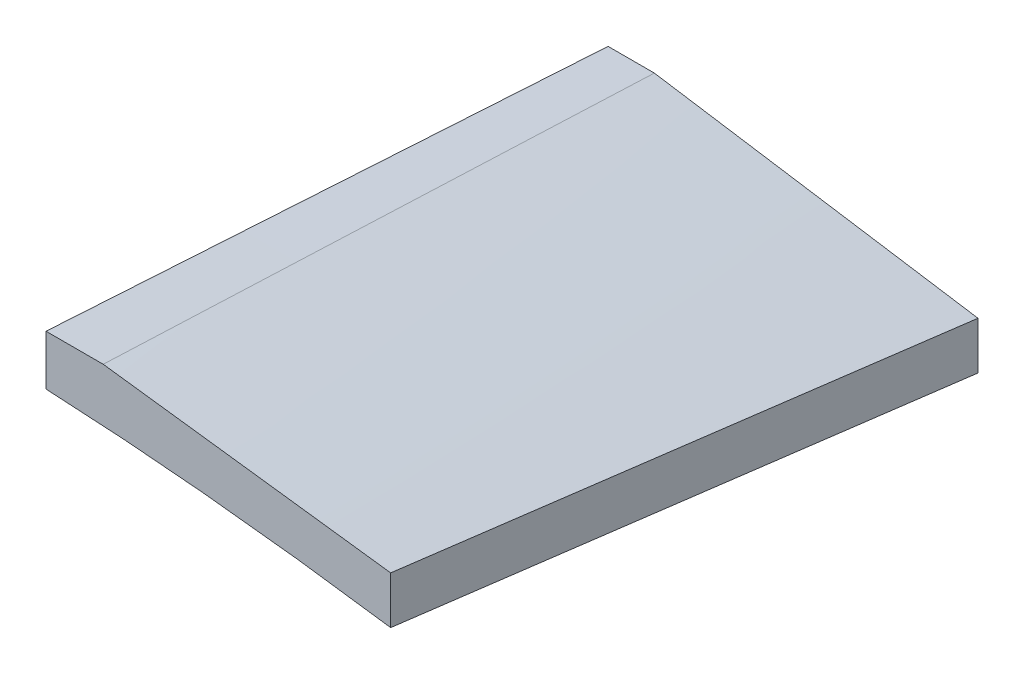
ISO-10303-21;
HEADER;
FILE_DESCRIPTION(('STEP AP214'),'2;1');
FILE_NAME('part.step','',(''),(''),'','','');
FILE_SCHEMA(('AUTOMOTIVE_DESIGN { 1 0 10303 214 1 1 1 1 }'));
ENDSEC;
DATA;
#1=APPLICATION_CONTEXT('core data for automotive mechanical design processes');
#2=APPLICATION_PROTOCOL_DEFINITION('international standard','automotive_design',2000,#1);
#3=PRODUCT_CONTEXT('',#1,'mechanical');
#4=PRODUCT('Part','Part','',(#3));
#5=PRODUCT_RELATED_PRODUCT_CATEGORY('part','',(#4));
#6=PRODUCT_DEFINITION_FORMATION('','',#4);
#7=PRODUCT_DEFINITION_CONTEXT('part definition',#1,'design');
#8=PRODUCT_DEFINITION('design','',#6,#7);
#9=PRODUCT_DEFINITION_SHAPE('','',#8);
#10=(LENGTH_UNIT() NAMED_UNIT(*) SI_UNIT(.MILLI.,.METRE.));
#11=(NAMED_UNIT(*) PLANE_ANGLE_UNIT() SI_UNIT($,.RADIAN.));
#12=(NAMED_UNIT(*) SI_UNIT($,.STERADIAN.) SOLID_ANGLE_UNIT());
#13=UNCERTAINTY_MEASURE_WITH_UNIT(LENGTH_MEASURE(1.E-05),#10,'distance_accuracy_value','');
#14=(GEOMETRIC_REPRESENTATION_CONTEXT(3) GLOBAL_UNCERTAINTY_ASSIGNED_CONTEXT((#13)) GLOBAL_UNIT_ASSIGNED_CONTEXT((#10,
#11,#12)) REPRESENTATION_CONTEXT('',''));
#15=CARTESIAN_POINT('',(0.,0.,0.));
#16=DIRECTION('',(0.,0.,1.));
#17=DIRECTION('',(1.,0.,0.));
#18=AXIS2_PLACEMENT_3D('',#15,#16,#17);
#19=CARTESIAN_POINT('',(0.,0.,619.76));
#20=DIRECTION('',(0.,0.,-1.));
#21=DIRECTION('',(-1.,0.,0.));
#22=AXIS2_PLACEMENT_3D('',#19,#20,#21);
#23=PLANE('',#22);
#24=CARTESIAN_POINT('',(122.012987748225,42.2689138855527,619.76));
#25=CARTESIAN_POINT('',(124.448241517671,42.1643767634276,619.76));
#26=CARTESIAN_POINT('',(126.882756849898,42.0438117710736,619.76));
#27=CARTESIAN_POINT('',(130.532827965172,41.8416953269316,619.76));
#28=CARTESIAN_POINT('',(131.748974807422,41.7707957864617,619.76));
#29=CARTESIAN_POINT('',(134.180864283447,41.6223601715288,619.76));
#30=CARTESIAN_POINT('',(135.396606916646,41.5448240876751,619.76));
#31=CARTESIAN_POINT('',(137.827325774478,41.3835929566903,619.76));
#32=CARTESIAN_POINT('',(139.042302119273,41.2998997180211,619.76));
#33=CARTESIAN_POINT('',(141.471841549765,41.1267282823664,619.76));
#34=CARTESIAN_POINT('',(142.686404635555,41.0372500866874,619.76));
#35=CARTESIAN_POINT('',(145.11488810786,40.8530114004872,619.76));
#36=CARTESIAN_POINT('',(146.328808573915,40.7582519561394,619.76));
#37=CARTESIAN_POINT('',(148.756268627971,40.5639758433482,619.76));
#38=CARTESIAN_POINT('',(149.969808215908,40.4644591741015,619.76));
#39=CARTESIAN_POINT('',(152.3963259651,40.2606522922155,619.76));
#40=CARTESIAN_POINT('',(153.609304179194,40.1563627089267,619.76));
#41=CARTESIAN_POINT('',(156.034834509922,39.9429445186549,619.76));
#42=CARTESIAN_POINT('',(157.247386626677,39.8338159130428,619.76));
#43=CARTESIAN_POINT('',(159.671962879002,39.610691255984,619.76));
#44=CARTESIAN_POINT('',(160.883987043973,39.4966955240975,619.76));
#45=CARTESIAN_POINT('',(163.307559130601,39.2637465944752,619.76));
#46=CARTESIAN_POINT('',(164.519107052186,39.1447933959834,619.76));
#47=CARTESIAN_POINT('',(166.941648698677,38.9018173315685,619.76));
#48=CARTESIAN_POINT('',(168.152642442773,38.7777946571532,619.76));
#49=CARTESIAN_POINT('',(170.574085315804,38.5245531442786,619.76));
#50=CARTESIAN_POINT('',(171.784534444878,38.3953343071575,619.76));
#51=CARTESIAN_POINT('',(175.415200716581,37.9997483867404,619.76));
#52=CARTESIAN_POINT('',(177.834561667416,37.7254694276855,619.76));
#53=CARTESIAN_POINT('',(181.462014219506,37.2990805125503,619.76));
#54=CARTESIAN_POINT('',(182.670991607541,37.1544442927972,619.76));
#55=CARTESIAN_POINT('',(185.088355361681,36.8603131262002,619.76));
#56=CARTESIAN_POINT('',(186.296741727862,36.7108181799761,619.76));
#57=CARTESIAN_POINT('',(189.921541429177,36.2552975464865,619.76));
#58=CARTESIAN_POINT('',(192.337081572201,35.9422966200059,619.76));
#59=CARTESIAN_POINT('',(195.959031665217,35.4602093026612,619.76));
#60=CARTESIAN_POINT('',(197.166282190393,35.2973933779906,619.76));
#61=CARTESIAN_POINT('',(199.580237180211,34.96775571681,619.76));
#62=CARTESIAN_POINT('',(200.786941644819,34.8009339800481,619.76));
#63=CARTESIAN_POINT('',(203.200168126187,34.4633045975705,619.76));
#64=CARTESIAN_POINT('',(204.406689974741,34.2924957503763,619.76));
#65=CARTESIAN_POINT('',(206.819182070088,33.9470314127565,619.76));
#66=CARTESIAN_POINT('',(208.025152317248,33.7723759248858,619.76));
#67=CARTESIAN_POINT('',(209.23084733782,33.595842069036,619.76));
#68=B_SPLINE_CURVE_WITH_KNOTS('',3,(#24,#25,#26,#27,#28,#29,#30,#31,#32,#33,#34,#35,#36,#37,#38,
#39,#40,#41,#42,#43,#44,#45,#46,#47,#48,#49,#50,#51,#52,#53,#54,#55,#56,#57,#58,#59,#60,#61,#62,
#63,#64,#65,#66,#67),.UNSPECIFIED.,.F.,.F.,(4,2,2,2,2,2,2,2,2,2,2,2,2,2,2,2,2,2,2,2,2,4),(0.,
7.31235704427351,10.9669728743561,14.6215938758074,18.275145705317,21.9286967096633,
25.5815265292785,29.2343569656651,32.886707124308,36.5390562481721,40.1911659380679,
43.8432761850205,47.4952485948345,51.1472200642427,58.4516908415903,62.1044786405917,
65.7572659736222,73.0643926505828,76.7189284709772,80.3734645211136,84.0291164232771,
87.6847658975796),.UNSPECIFIED.);
#69=CARTESIAN_POINT('',(122.012987748225,42.2689138855518,619.759999999985));
#70=VERTEX_POINT('',#69);
#71=CARTESIAN_POINT('',(209.230847337816,33.5958420690439,619.760000000093));
#72=VERTEX_POINT('',#71);
#73=EDGE_CURVE('E105',#70,#72,#68,.T.);
#74=ORIENTED_EDGE('',*,*,#73,.T.);
#75=DIRECTION('',(0.,1.,0.));
#76=VECTOR('',#75,1.);
#77=CARTESIAN_POINT('',(209.230847335755,9.36643436036436,619.76));
#78=LINE('',#77,#76);
#79=CARTESIAN_POINT('',(209.230847337816,45.5958420690439,619.760000000093));
#80=VERTEX_POINT('',#79);
#81=EDGE_CURVE('E101',#72,#80,#78,.T.);
#82=ORIENTED_EDGE('',*,*,#81,.T.);
#83=CARTESIAN_POINT('',(209.230847337821,45.5958420690359,619.76));
#84=CARTESIAN_POINT('',(201.586387683056,46.5784670200576,619.76));
#85=CARTESIAN_POINT('',(193.941928028292,47.5610919710792,619.76));
#86=CARTESIAN_POINT('',(177.996204794492,49.610767974255,619.76));
#87=CARTESIAN_POINT('',(169.694941215457,50.6778190264092,619.76));
#88=CARTESIAN_POINT('',(153.092414057386,52.8119211307177,619.76));
#89=CARTESIAN_POINT('',(144.791150478351,53.878972182872,619.76));
#90=CARTESIAN_POINT('',(136.489886899315,54.9460232350262,619.76));
#91=B_SPLINE_CURVE_WITH_KNOTS('',3,(#83,#84,#85,#86,#87,#88,#89,#90),.UNSPECIFIED.,.F.,.F.,(4,2,
2,4),(0.,23.1220638540164,48.2307510878943,73.3394383217721),.UNSPECIFIED.);
#92=CARTESIAN_POINT('',(136.489886899315,54.9460232350262,619.76));
#93=VERTEX_POINT('',#92);
#94=EDGE_CURVE('E94',#80,#93,#91,.T.);
#95=ORIENTED_EDGE('',*,*,#94,.T.);
#96=DIRECTION('',(-1.,0.,0.));
#97=VECTOR('',#96,1.);
#98=CARTESIAN_POINT('',(111.489886899315,54.9460232350262,619.76));
#99=LINE('',#98,#97);
#100=CARTESIAN_POINT('',(122.012987748225,54.9460232350253,619.759999999985));
#101=VERTEX_POINT('',#100);
#102=EDGE_CURVE('E151',#93,#101,#99,.T.);
#103=ORIENTED_EDGE('',*,*,#102,.T.);
#104=DIRECTION('',(0.,-1.,0.));
#105=VECTOR('',#104,1.);
#106=CARTESIAN_POINT('',(122.012987748225,0.,619.76));
#107=LINE('',#106,#105);
#108=EDGE_CURVE('E48',#101,#70,#107,.T.);
#109=ORIENTED_EDGE('',*,*,#108,.T.);
#110=EDGE_LOOP('',(#74,#82,#95,#103,#109));
#111=FACE_BOUND('',#110,.T.);
#112=ADVANCED_FACE('F44',(#111),#23,.F.);
#113=CARTESIAN_POINT('',(122.012987748225,6.34998004884585,335.28));
#114=DIRECTION('',(1.,0.,0.));
#115=DIRECTION('',(0.,1.,0.));
#116=AXIS2_PLACEMENT_3D('',#113,#114,#115);
#117=PLANE('',#116);
#118=CARTESIAN_POINT('',(122.012987748225,32.964943378498,477.520000000027));
#119=CARTESIAN_POINT('',(122.012987748225,33.7396427843838,489.373374631299));
#120=CARTESIAN_POINT('',(122.012987748225,34.5144885268928,501.226739698934));
#121=CARTESIAN_POINT('',(122.012987748225,36.0644899697563,524.933449559267));
#122=CARTESIAN_POINT('',(122.012987748225,36.8396456701105,536.786794351965));
#123=CARTESIAN_POINT('',(122.012987748225,38.3902843144604,560.493462533076));
#124=CARTESIAN_POINT('',(122.012987748225,39.1657672584561,572.346785921489));
#125=CARTESIAN_POINT('',(122.012987748225,40.7170777648265,596.053410156219));
#126=CARTESIAN_POINT('',(122.012987748225,41.4929053272015,607.906711002537));
#127=CARTESIAN_POINT('',(122.012987748225,42.2689138855518,619.759999999985));
#128=B_SPLINE_CURVE_WITH_KNOTS('',3,(#118,#119,#120,#121,#122,#123,#124,#125,#126,#127),
.UNSPECIFIED.,.F.,.F.,(4,2,2,2,4),(0.,35.6359908498739,71.2719816725816,106.907972496009,
142.543963346602),.UNSPECIFIED.);
#129=CARTESIAN_POINT('',(122.012987748225,32.9649433784963,477.52));
#130=VERTEX_POINT('',#129);
#131=EDGE_CURVE('E146',#130,#70,#128,.T.);
#132=ORIENTED_EDGE('',*,*,#131,.T.);
#133=ORIENTED_EDGE('',*,*,#108,.F.);
#134=CARTESIAN_POINT('',(122.012987748225,54.9460232350253,619.759999999985));
#135=CARTESIAN_POINT('',(122.012987748225,53.9285154919096,603.124421962868));
#136=CARTESIAN_POINT('',(122.012987748225,52.9113466812346,586.488823197332));
#137=CARTESIAN_POINT('',(122.012987748225,50.8776413598084,553.217587032311));
#138=CARTESIAN_POINT('',(122.012987748225,49.8611048490567,536.581949632826));
#139=CARTESIAN_POINT('',(122.012987748225,47.9809463918115,505.804208871983));
#140=CARTESIAN_POINT('',(122.012987748225,47.1172430894256,491.66211048049));
#141=CARTESIAN_POINT('',(122.012987748225,46.2537378008114,477.520000000027));
#142=B_SPLINE_CURVE_WITH_KNOTS('',3,(#134,#135,#136,#137,#138,#139,#140,#141),.UNSPECIFIED.,.F.,
.F.,(4,2,2,4),(0.,50.0000000704006,100.000000093806,142.505345312347),.UNSPECIFIED.);
#143=CARTESIAN_POINT('',(122.012987748225,46.2537378008098,477.52));
#144=VERTEX_POINT('',#143);
#145=EDGE_CURVE('E100',#101,#144,#142,.T.);
#146=ORIENTED_EDGE('',*,*,#145,.T.);
#147=DIRECTION('',(0.,-1.,0.));
#148=VECTOR('',#147,1.);
#149=CARTESIAN_POINT('',(122.012987748225,0.,477.52));
#150=LINE('',#149,#148);
#151=EDGE_CURVE('E108',#144,#130,#150,.T.);
#152=ORIENTED_EDGE('',*,*,#151,.T.);
#153=EDGE_LOOP('',(#132,#133,#146,#152));
#154=FACE_BOUND('',#153,.T.);
#155=ADVANCED_FACE('F120',(#154),#117,.F.);
#156=CARTESIAN_POINT('',(0.,0.,477.52));
#157=DIRECTION('',(0.,0.,-1.));
#158=DIRECTION('',(-1.,0.,0.));
#159=AXIS2_PLACEMENT_3D('',#156,#157,#158);
#160=PLANE('',#159);
#161=CARTESIAN_POINT('',(122.012987748225,32.9649433784963,477.52));
#162=CARTESIAN_POINT('',(123.321545248897,32.8786607647076,477.52));
#163=CARTESIAN_POINT('',(124.62981616606,32.7880799662694,477.52));
#164=CARTESIAN_POINT('',(127.245760118867,32.5987877007624,477.52));
#165=CARTESIAN_POINT('',(128.553433158991,32.5000762956549,477.52));
#166=CARTESIAN_POINT('',(131.16761456649,32.2950312707333,477.52));
#167=CARTESIAN_POINT('',(132.47412319288,32.188700945838,477.52));
#168=CARTESIAN_POINT('',(135.086540232052,31.9688943789943,477.52));
#169=CARTESIAN_POINT('',(136.392448643973,31.8554181268355,477.52));
#170=CARTESIAN_POINT('',(139.003285971061,31.6218386650376,477.52));
#171=CARTESIAN_POINT('',(140.308215061148,31.50173740807,477.52));
#172=CARTESIAN_POINT('',(142.917482006573,31.2552859550511,477.52));
#173=CARTESIAN_POINT('',(144.221819862057,31.1289357605477,477.52));
#174=CARTESIAN_POINT('',(146.829670410266,30.8705402268589,477.52));
#175=CARTESIAN_POINT('',(148.13318321504,30.7384960165901,477.52));
#176=CARTESIAN_POINT('',(150.739680426974,30.4692929187873,477.52));
#177=CARTESIAN_POINT('',(152.042664834032,30.3321340302636,477.52));
#178=CARTESIAN_POINT('',(154.647911546336,30.052696205779,477.52));
#179=CARTESIAN_POINT('',(155.950173923956,29.9104179447905,477.52));
#180=CARTESIAN_POINT('',(158.554121027166,29.6206733536585,477.52));
#181=CARTESIAN_POINT('',(159.855805752924,29.4732070250371,477.52));
#182=CARTESIAN_POINT('',(162.458487831246,29.1730656072502,477.52));
#183=CARTESIAN_POINT('',(163.759485223415,29.0203908615777,477.52));
#184=CARTESIAN_POINT('',(166.360846686585,28.7097357006451,477.52));
#185=CARTESIAN_POINT('',(167.661210757489,28.5517552845685,477.52));
#186=CARTESIAN_POINT('',(170.261218478524,28.230366143356,477.52));
#187=CARTESIAN_POINT('',(171.560862154044,28.0669576237585,477.52));
#188=CARTESIAN_POINT('',(174.159436146524,27.7345735555051,477.52));
#189=CARTESIAN_POINT('',(175.458366463669,27.5655980082786,477.52));
#190=CARTESIAN_POINT('',(179.354229747186,27.0501660324726,477.52));
#191=CARTESIAN_POINT('',(181.950046872697,26.6952275002948,477.52));
#192=CARTESIAN_POINT('',(185.841689683171,26.1467332831833,477.52));
#193=CARTESIAN_POINT('',(187.138654755783,25.9612061770152,477.52));
#194=CARTESIAN_POINT('',(189.731826764467,25.5849260150743,477.52));
#195=CARTESIAN_POINT('',(191.028033700634,25.3941729599659,477.52));
#196=CARTESIAN_POINT('',(194.916090818966,24.8143328332849,477.52));
#197=CARTESIAN_POINT('',(197.506825703627,24.4177427176567,477.52));
#198=CARTESIAN_POINT('',(201.391147734804,23.8093169061479,477.52));
#199=CARTESIAN_POINT('',(202.685797417346,23.6042232988153,477.52));
#200=CARTESIAN_POINT('',(205.274408490368,23.1897310203627,477.52));
#201=CARTESIAN_POINT('',(206.5683698808,22.98033234894,477.52));
#202=CARTESIAN_POINT('',(209.1559973362,22.5572470913426,477.52));
#203=CARTESIAN_POINT('',(210.449663189856,22.343559213511,477.52));
#204=CARTESIAN_POINT('',(213.036305992117,21.9120589734394,477.52));
#205=CARTESIAN_POINT('',(214.329282941197,21.6942466140486,477.52));
#206=CARTESIAN_POINT('',(215.621917546117,21.4744225332154,477.52));
#207=B_SPLINE_CURVE_WITH_KNOTS('',3,(#161,#162,#163,#164,#165,#166,#167,#168,#169,#170,#171,
#172,#173,#174,#175,#176,#177,#178,#179,#180,#181,#182,#183,#184,#185,#186,#187,#188,#189,#190,
#191,#192,#193,#194,#195,#196,#197,#198,#199,#200,#201,#202,#203,#204,#205,#206),.UNSPECIFIED.,
.F.,.F.,(4,2,2,2,2,2,2,2,2,2,2,2,2,2,2,2,2,2,2,2,2,2,4),(0.,3.93418541521632,7.86834085179417,
11.8008050533507,15.733274873919,19.6645917575364,23.5959076673278,27.5264476916494,
31.4569884764975,35.3870129177525,39.317036205941,43.2468008098117,47.1765660183761,
51.1061825933162,55.0357981593801,62.895598077023,66.8260922316671,70.7565858866184,
78.6192444003735,82.5516217434674,86.4839993630797,90.4175794984262,94.3511569166042),.UNSPECIFIED.);
#208=CARTESIAN_POINT('',(215.621917546109,21.4744225332311,477.520000000185));
#209=VERTEX_POINT('',#208);
#210=EDGE_CURVE('E145',#130,#209,#207,.T.);
#211=ORIENTED_EDGE('',*,*,#210,.F.);
#212=ORIENTED_EDGE('',*,*,#151,.F.);
#213=DIRECTION('',(-1.,0.,0.));
#214=VECTOR('',#213,1.);
#215=CARTESIAN_POINT('',(108.722936009759,46.2537378008098,477.52));
#216=LINE('',#215,#214);
#217=CARTESIAN_POINT('',(133.722936009759,46.2537378008098,477.52));
#218=VERTEX_POINT('',#217);
#219=EDGE_CURVE('E180',#218,#144,#216,.T.);
#220=ORIENTED_EDGE('',*,*,#219,.F.);
#221=CARTESIAN_POINT('',(215.621917546117,33.4744225332154,477.52));
#222=CARTESIAN_POINT('',(208.006711817888,34.6626804700425,477.52));
#223=CARTESIAN_POINT('',(200.391506089658,35.8509384068696,477.52));
#224=CARTESIAN_POINT('',(185.1610946332,38.2274542805238,477.52));
#225=CARTESIAN_POINT('',(177.54588890497,39.4157122173509,477.52));
#226=CARTESIAN_POINT('',(157.86143412108,42.4872260363886,477.52));
#227=CARTESIAN_POINT('',(145.79218506542,44.3704819185992,477.52));
#228=CARTESIAN_POINT('',(133.722936009759,46.2537378008098,477.52));
#229=B_SPLINE_CURVE_WITH_KNOTS('',3,(#221,#222,#223,#224,#225,#226,#227,#228),.UNSPECIFIED.,.F.,
.F.,(4,2,2,4),(0.,23.1220638540165,46.244127708033,82.8900119157991),.UNSPECIFIED.);
#230=CARTESIAN_POINT('',(215.621917546109,33.4744225332311,477.520000000185));
#231=VERTEX_POINT('',#230);
#232=EDGE_CURVE('E187',#231,#218,#229,.T.);
#233=ORIENTED_EDGE('',*,*,#232,.F.);
#234=DIRECTION('',(0.,1.,0.));
#235=VECTOR('',#234,1.);
#236=CARTESIAN_POINT('',(215.62191754199,9.36643436036436,477.52));
#237=LINE('',#236,#235);
#238=EDGE_CURVE('E61',#209,#231,#237,.T.);
#239=ORIENTED_EDGE('',*,*,#238,.F.);
#240=EDGE_LOOP('',(#211,#212,#220,#233,#239));
#241=FACE_BOUND('',#240,.T.);
#242=ADVANCED_FACE('F113',(#241),#160,.T.);
#243=CARTESIAN_POINT('',(130.956058059283,37.574856415899,335.28));
#244=CARTESIAN_POINT('',(133.722938387168,46.2481983373047,477.52169947526));
#245=CARTESIAN_POINT('',(136.489876885067,54.9368025875343,619.762103902452));
#246=CARTESIAN_POINT('',(139.256928095494,63.6548897190744,762.));
#247=CARTESIAN_POINT('',(126.789391392616,37.5748564158991,335.28));
#248=CARTESIAN_POINT('',(129.556271720501,46.2481983373047,477.52169947526));
#249=CARTESIAN_POINT('',(132.3232102184,54.9368025875343,619.762103902452));
#250=CARTESIAN_POINT('',(135.090261428827,63.6548897190744,762.));
#251=CARTESIAN_POINT('',(118.456058059283,37.574856415899,335.28));
#252=CARTESIAN_POINT('',(121.222938387168,46.2481983373047,477.52169947526));
#253=CARTESIAN_POINT('',(123.989876885067,54.9368025875344,619.762103902452));
#254=CARTESIAN_POINT('',(126.756928095494,63.6548897190745,762.000000000001));
#255=CARTESIAN_POINT('',(105.956058059283,37.5748564158991,335.28));
#256=CARTESIAN_POINT('',(108.722938387168,46.2481983373046,477.52169947526));
#257=CARTESIAN_POINT('',(111.489876885067,54.9368025875342,619.762103902451));
#258=CARTESIAN_POINT('',(114.256928095494,63.6548897190743,761.999999999999));
#259=CARTESIAN_POINT('',(93.4560580592829,37.574856415899,335.28));
#260=CARTESIAN_POINT('',(96.222938387168,46.2481983373047,477.52169947526));
#261=CARTESIAN_POINT('',(98.989876885067,54.9368025875343,619.762103902452));
#262=CARTESIAN_POINT('',(101.756928095494,63.6548897190744,762.));
#263=CARTESIAN_POINT('',(85.1227247259497,37.574856415899,335.28));
#264=CARTESIAN_POINT('',(87.8896050538347,46.2481983373046,477.52169947526));
#265=CARTESIAN_POINT('',(90.6565435517336,54.9368025875343,619.762103902452));
#266=CARTESIAN_POINT('',(93.4235947621608,63.6548897190744,762.));
#267=CARTESIAN_POINT('',(80.956058059283,37.5748564158991,335.28));
#268=CARTESIAN_POINT('',(83.722938387168,46.2481983373047,477.52169947526));
#269=CARTESIAN_POINT('',(86.489876885067,54.9368025875343,619.762103902452));
#270=CARTESIAN_POINT('',(89.2569280954942,63.6548897190744,762.));
#271=B_SPLINE_SURFACE_WITH_KNOTS('',3,3,((#243,#244,#245,#246),(#247,#248,#249,#250),(#251,#252,
#253,#254),(#255,#256,#257,#258),(#259,#260,#261,#262),(#263,#264,#265,#266),(#267,#268,#269,
#270)),.UNSPECIFIED.,.F.,.F.,.F.,(4,1,1,1,4),(4,4),(0.19667758886926,0.224376205647247,
0.252074822425234,0.279773439203221,0.307472055981208),(0.,1.),.UNSPECIFIED.);
#272=CARTESIAN_POINT('',(130.956058059283,37.574856415899,335.28));
#273=CARTESIAN_POINT('',(133.722938387168,46.2481983373047,477.52169947526));
#274=CARTESIAN_POINT('',(136.489876885067,54.9368025875343,619.762103902452));
#275=CARTESIAN_POINT('',(139.256928095494,63.6548897190744,762.));
#276=B_SPLINE_CURVE_WITH_KNOTS('',3,(#272,#273,#274,#275),.UNSPECIFIED.,.F.,.F.,(4,4),(0.,1.),.UNSPECIFIED.);
#277=EDGE_CURVE('E54',#218,#93,#276,.T.);
#278=ORIENTED_EDGE('',*,*,#277,.F.);
#279=ORIENTED_EDGE('',*,*,#219,.T.);
#280=ORIENTED_EDGE('',*,*,#145,.F.);
#281=ORIENTED_EDGE('',*,*,#102,.F.);
#282=EDGE_LOOP('',(#278,#279,#280,#281));
#283=FACE_BOUND('',#282,.T.);
#284=ADVANCED_FACE('F119',(#283),#271,.T.);
#285=CARTESIAN_POINT('',(222.012987748225,21.3664343603644,335.28));
#286=CARTESIAN_POINT('',(215.621841191138,33.4689125503059,477.52169947526));
#287=CARTESIAN_POINT('',(209.230752804065,45.5866530690714,619.762103902452));
#288=CARTESIAN_POINT('',(202.839777129521,57.7338764691475,762.));
#289=CARTESIAN_POINT('',(214.424910274146,22.7171361983256,335.28));
#290=CARTESIAN_POINT('',(208.796932624141,34.5338530325558,477.52169947526));
#291=CARTESIAN_POINT('',(203.169013144149,46.36583219561,619.762103902452));
#292=CARTESIAN_POINT('',(197.541206376685,58.2272942399747,762.));
#293=CARTESIAN_POINT('',(199.24875532599,25.418539874248,335.28));
#294=CARTESIAN_POINT('',(195.147115490146,36.6637339970556,477.52169947526));
#295=CARTESIAN_POINT('',(191.045533824316,47.9241904486871,619.762103902452));
#296=CARTESIAN_POINT('',(186.944064871014,59.2141297816292,762.));
#297=CARTESIAN_POINT('',(176.484522903754,29.4706453881317,335.28));
#298=CARTESIAN_POINT('',(174.672389789153,39.8585554438053,477.52169947526));
#299=CARTESIAN_POINT('',(172.860314844566,50.2617278283029,619.762103902452));
#300=CARTESIAN_POINT('',(171.048352612508,60.694383094111,762.000000000001));
#301=CARTESIAN_POINT('',(153.720290481519,33.5227509020154,335.28));
#302=CARTESIAN_POINT('',(154.197664088161,43.053376890555,477.52169947526));
#303=CARTESIAN_POINT('',(154.675095864817,52.5992652079185,619.762103902451));
#304=CARTESIAN_POINT('',(155.152640354001,62.1746364065926,761.999999999999));
#305=CARTESIAN_POINT('',(138.544135533361,36.2241545779378,335.28));
#306=CARTESIAN_POINT('',(140.547846954166,45.1832578550548,477.52169947526));
#307=CARTESIAN_POINT('',(142.551616544983,54.1576234609957,619.762103902452));
#308=CARTESIAN_POINT('',(144.55549884833,63.1614719482472,762.));
#309=CARTESIAN_POINT('',(130.956058059283,37.574856415899,335.28));
#310=CARTESIAN_POINT('',(133.722938387168,46.2481983373047,477.52169947526));
#311=CARTESIAN_POINT('',(136.489876885067,54.9368025875343,619.762103902452));
#312=CARTESIAN_POINT('',(139.256928095494,63.6548897190744,762.));
#313=B_SPLINE_SURFACE_WITH_KNOTS('',3,3,((#285,#286,#287,#288),(#289,#290,#291,#292),(#293,#294,
#295,#296),(#297,#298,#299,#300),(#301,#302,#303,#304),(#305,#306,#307,#308),(#309,#310,#311,
#312)),.UNSPECIFIED.,.F.,.F.,.F.,(4,1,1,1,4),(4,4),(0.0265906721068675,0.0691124012974655,
0.111634130488064,0.154155859678662,0.19667758886926),(0.,1.),.UNSPECIFIED.);
#314=CARTESIAN_POINT('',(222.012987748225,21.3664343603644,335.28));
#315=CARTESIAN_POINT('',(215.621841191138,33.4689125503059,477.52169947526));
#316=CARTESIAN_POINT('',(209.230752804065,45.5866530690714,619.762103902452));
#317=CARTESIAN_POINT('',(202.839777129521,57.7338764691475,762.));
#318=B_SPLINE_CURVE_WITH_KNOTS('',3,(#314,#315,#316,#317),.UNSPECIFIED.,.F.,.F.,(4,4),(0.,1.),.UNSPECIFIED.);
#319=EDGE_CURVE('E11',#231,#80,#318,.T.);
#320=ORIENTED_EDGE('',*,*,#319,.F.);
#321=ORIENTED_EDGE('',*,*,#232,.T.);
#322=ORIENTED_EDGE('',*,*,#277,.T.);
#323=ORIENTED_EDGE('',*,*,#94,.F.);
#324=EDGE_LOOP('',(#320,#321,#322,#323));
#325=FACE_BOUND('',#324,.T.);
#326=ADVANCED_FACE('F96',(#325),#313,.T.);
#327=CARTESIAN_POINT('',(9.29077044004429E-07,6.34998004884775,335.28));
#328=CARTESIAN_POINT('',(8.33297207421032,14.5787844685806,477.52169947526));
#329=CARTESIAN_POINT('',(16.6660013893575,22.8228512171374,619.762103902452));
#330=CARTESIAN_POINT('',(24.9991434170329,31.0964008470047,762.));
#331=CARTESIAN_POINT('',(9.29077600369592E-07,7.45438325082316,335.28));
#332=CARTESIAN_POINT('',(8.33297207421069,15.6111681299376,477.52169947526));
#333=CARTESIAN_POINT('',(16.6660013893577,23.783215337876,619.762103902452));
#334=CARTESIAN_POINT('',(24.9991434170329,31.9847454271249,762.));
#335=CARTESIAN_POINT('',(0.969916519496457,9.6613167038059,335.28));
#336=CARTESIAN_POINT('',(9.22997388777417,17.6892352496878,477.521699475259));
#337=CARTESIAN_POINT('',(17.4900894260658,25.7324161243937,619.762103902451));
#338=CARTESIAN_POINT('',(25.7503176768857,33.8050798804101,762.));
#339=CARTESIAN_POINT('',(3.44848156516794,12.0366302116868,335.28));
#340=CARTESIAN_POINT('',(11.5121687647093,19.9379477005165,477.52169947526));
#341=CARTESIAN_POINT('',(19.5759141342645,27.8545275181702,619.762103902452));
#342=CARTESIAN_POINT('',(27.639772216348,35.8005902171344,762.000000000001));
#343=CARTESIAN_POINT('',(5.45941166538086,13.4428022435293,335.28));
#344=CARTESIAN_POINT('',(13.3630371949687,21.2745392258276,477.521699475259));
#345=CARTESIAN_POINT('',(21.2667208945703,29.1215385369498,619.762103902452));
#346=CARTESIAN_POINT('',(29.1705173067003,36.9980207293825,762.));
#347=CARTESIAN_POINT('',(6.98203766683405,14.316970710559,335.28));
#348=CARTESIAN_POINT('',(14.7696273274846,22.112594899526,477.52169947526));
#349=CARTESIAN_POINT('',(22.557275158149,29.923481417317,619.762103902452));
#350=CARTESIAN_POINT('',(30.3450357013417,37.7638508164184,762.));
#351=CARTESIAN_POINT('',(8.54472942418297,15.0888371575498,335.28));
#352=CARTESIAN_POINT('',(16.217370772052,22.8607836546203,477.52169947526));
#353=CARTESIAN_POINT('',(23.8900702899349,30.6479924805147,619.762103902452));
#354=CARTESIAN_POINT('',(31.5628825203461,38.4646841877197,762.));
#355=CARTESIAN_POINT('',(10.1582127248828,15.8184229079955,335.28));
#356=CARTESIAN_POINT('',(17.7118720922566,23.5698254554367,477.521699475259));
#357=CARTESIAN_POINT('',(25.2655896296443,31.3364903317018,619.762103902451));
#358=CARTESIAN_POINT('',(32.8194198795603,39.1326380892775,761.999999999999));
#359=CARTESIAN_POINT('',(11.8098506399446,16.4960217707987,335.28));
#360=CARTESIAN_POINT('',(19.2427460811811,24.2313837922629,477.521699475261));
#361=CARTESIAN_POINT('',(26.6756996924314,31.9820081425512,619.762103902453));
#362=CARTESIAN_POINT('',(34.1087660162101,39.76211537415,762.000000000002));
#363=CARTESIAN_POINT('',(13.4900691645311,17.1289319071832,335.28));
#364=CARTESIAN_POINT('',(20.801220906549,24.8518102555458,477.521699475259));
#365=CARTESIAN_POINT('',(28.1124308185809,32.5899509327323,619.762103902451));
#366=CARTESIAN_POINT('',(35.423753443141,40.3575744912294,761.999999999999));
#367=CARTESIAN_POINT('',(15.1903900958544,17.7169000721208,335.28));
#368=CARTESIAN_POINT('',(22.3776261706481,25.4304482833263,477.52169947526));
#369=CARTESIAN_POINT('',(29.5649204154557,33.1592588233557,619.762103902452));
#370=CARTESIAN_POINT('',(36.7523273727916,40.9175522446957,761.999999999999));
#371=CARTESIAN_POINT('',(17.465921328655,18.443907318319,335.28));
#372=CARTESIAN_POINT('',(24.4893873514633,26.1494155039185,477.52169947526));
#373=CARTESIAN_POINT('',(31.5129115442856,33.870186018342,619.762103902453));
#374=CARTESIAN_POINT('',(38.5365484496361,41.620439414076,762.000000000001));
#375=CARTESIAN_POINT('',(20.3261253650035,19.2567063001384,335.28));
#376=CARTESIAN_POINT('',(27.1442798687524,26.9590316546654,477.521699475259));
#377=CARTESIAN_POINT('',(33.9624925425152,34.6766193380163,619.76210390245));
#378=CARTESIAN_POINT('',(40.7808179288063,42.4236899026778,761.999999999998));
#379=CARTESIAN_POINT('',(23.7782685903277,20.118367205322,335.28));
#380=CARTESIAN_POINT('',(30.3520648212409,27.826403434635,477.52169947526));
#381=CARTESIAN_POINT('',(36.9259192221679,35.549701992772,619.762103902453));
#382=CARTESIAN_POINT('',(43.4998863356233,43.3024834322195,762.000000000001));
#383=CARTESIAN_POINT('',(27.2569743923509,20.9064140542042,335.28));
#384=CARTESIAN_POINT('',(33.5853102584017,28.6257194399167,477.52169947526));
#385=CARTESIAN_POINT('',(39.9137042944664,36.3602871544532,619.762103902451));
#386=CARTESIAN_POINT('',(46.2422110430595,44.1243377503001,761.999999999999));
#387=CARTESIAN_POINT('',(30.7542530905361,21.6165466303187,335.279999999999));
#388=CARTESIAN_POINT('',(36.8375774721128,29.3523453451718,477.521699475259));
#389=CARTESIAN_POINT('',(42.9209600237033,37.103406388849,619.762103902451));
#390=CARTESIAN_POINT('',(49.0044552878221,44.8839503138367,762.));
#391=CARTESIAN_POINT('',(34.2664636940487,22.2460759079554,335.280000000001));
#392=CARTESIAN_POINT('',(40.1050244166742,30.0039988320751,477.52169947526));
#393=CARTESIAN_POINT('',(45.9436433093136,37.7771840850187,619.762103902452));
#394=CARTESIAN_POINT('',(51.7823749144814,45.579852219273,762.));
#395=CARTESIAN_POINT('',(37.7902260736038,22.8004936568621,335.279999999999));
#396=CARTESIAN_POINT('',(43.384705041758,30.5859470440672,477.521699475259));
#397=CARTESIAN_POINT('',(48.979242179926,38.3866627600962,619.762103902451));
#398=CARTESIAN_POINT('',(54.5738920306224,46.2168613574358,761.999999999999));
#399=CARTESIAN_POINT('',(41.3242497765985,23.2878811261495,335.28));
#400=CARTESIAN_POINT('',(46.675131793767,31.1056757552862,477.52169947526));
#401=CARTESIAN_POINT('',(52.0260719809494,38.9387327132469,619.762103902453));
#402=CARTESIAN_POINT('',(57.3771248806601,46.8012725525181,762.000000000001));
#403=CARTESIAN_POINT('',(44.8658239828752,23.7149223381359,335.28));
#404=CARTESIAN_POINT('',(49.9736457372606,31.5693936302263,477.521699475259));
#405=CARTESIAN_POINT('',(55.0815256616599,39.4391272511406,619.762103902451));
#406=CARTESIAN_POINT('',(60.1895182985876,47.3383437533655,761.999999999999));
#407=CARTESIAN_POINT('',(48.4136829142244,24.0896238833925,335.28));
#408=CARTESIAN_POINT('',(53.2790352364492,31.9845911908484,477.52169947526));
#409=CARTESIAN_POINT('',(58.144445728688,39.8948208271283,619.762103902453));
#410=CARTESIAN_POINT('',(63.009968933455,47.8345333447187,762.000000000001));
#411=CARTESIAN_POINT('',(53.1486242463732,24.5260190039242,335.28));
#412=CARTESIAN_POINT('',(57.6912752508218,32.4792550117327,477.521699475259));
#413=CARTESIAN_POINT('',(62.2339844252844,40.4477533483652,619.762103902451));
#414=CARTESIAN_POINT('',(66.7768063122753,48.4457345663082,761.999999999999));
#415=CARTESIAN_POINT('',(59.0789436792651,24.9574757661192,335.28));
#416=CARTESIAN_POINT('',(63.2200221820315,32.9915421905065,477.52169947526));
#417=CARTESIAN_POINT('',(67.3611588548119,41.0408709437178,619.762103902453));
#418=CARTESIAN_POINT('',(71.5024082401206,49.1196825782396,762.000000000001));
#419=CARTESIAN_POINT('',(66.2030814892412,25.3140522243183,335.28));
#420=CARTESIAN_POINT('',(69.8642211934628,33.4561192258002,477.52169947526));
#421=CARTESIAN_POINT('',(73.5254190676983,41.613448556106,619.762103902451));
#422=CARTESIAN_POINT('',(77.1867296544622,49.8002607677224,761.999999999999));
#423=CARTESIAN_POINT('',(73.3339674682549,25.523312736422,335.279999999999));
#424=CARTESIAN_POINT('',(76.5177056557658,33.7833803999775,477.52169947526));
#425=CARTESIAN_POINT('',(79.7015020132907,42.0587103923571,619.762103902452));
#426=CARTESIAN_POINT('',(82.8854110833438,50.3635232660471,762.000000000001));
#427=CARTESIAN_POINT('',(80.4669900342226,25.5957976291351,335.280000000001));
#428=CARTESIAN_POINT('',(83.1755672296286,33.9831036079315,477.52169947526));
#429=CARTESIAN_POINT('',(85.8842025950485,42.3856719155519,619.762103902451));
#430=CARTESIAN_POINT('',(88.5929506729966,50.8177231044828,761.999999999999));
#431=CARTESIAN_POINT('',(87.6002131526684,25.5406730290278,335.279999999999));
#432=CARTESIAN_POINT('',(89.8360561254533,34.0637012643954,477.521699475259));
#433=CARTESIAN_POINT('',(92.071957268252,42.6019918285869,619.762103902452));
#434=CARTESIAN_POINT('',(94.3079711235791,51.1697652740891,762.));
#435=CARTESIAN_POINT('',(94.731344048156,25.3623320865792,335.28));
#436=CARTESIAN_POINT('',(96.4968287829496,34.0292359395454,477.52169947526));
#437=CARTESIAN_POINT('',(98.262371687757,42.7114021213355,619.762103902453));
#438=CARTESIAN_POINT('',(100.028027305093,51.4230511844363,762.000000000001));
#439=CARTESIAN_POINT('',(101.858719846003,25.0679177013017,335.28));
#440=CARTESIAN_POINT('',(103.156275912104,33.8864442696627,477.521699475259));
#441=CARTESIAN_POINT('',(104.453890148219,42.7202331668477,619.762103902451));
#442=CARTESIAN_POINT('',(105.751617096862,51.5835049453433,761.999999999999));
#443=CARTESIAN_POINT('',(108.98145520224,24.6671471282029,335.28));
#444=CARTESIAN_POINT('',(109.813353159231,33.6444202192184,477.52169947526));
#445=CARTESIAN_POINT('',(110.645309286237,42.6369556390579,619.762103902452));
#446=CARTESIAN_POINT('',(111.477378125771,51.6589739402079,762.));
#447=CARTESIAN_POINT('',(116.098371799005,24.1694505600281,335.28));
#448=CARTESIAN_POINT('',(116.466790352252,33.3119415656027,477.521699475259));
#449=CARTESIAN_POINT('',(116.835267075513,42.4696949000013,619.762103902452));
#450=CARTESIAN_POINT('',(117.203856511302,51.6569311157104,762.));
#451=CARTESIAN_POINT('',(123.208750062991,23.5842845444573,335.280000000001));
#452=CARTESIAN_POINT('',(123.115731295253,32.8978674091282,477.52169947526));
#453=CARTESIAN_POINT('',(123.022770697529,42.2267126026231,619.762103902452));
#454=CARTESIAN_POINT('',(122.929922812333,51.5850406774286,762.));
#455=CARTESIAN_POINT('',(130.310988961638,22.921250348438,335.279999999999));
#456=CARTESIAN_POINT('',(129.758512205833,32.411084966105,477.521699475259));
#457=CARTESIAN_POINT('',(129.206093620042,41.9161819125961,619.762103902451));
#458=CARTESIAN_POINT('',(128.65378774678,51.4507617403976,761.999999999999));
#459=CARTESIAN_POINT('',(137.406778455928,22.1873993770708,335.28));
#460=CARTESIAN_POINT('',(136.396633479512,31.8582341206284,477.52169947526));
#461=CARTESIAN_POINT('',(135.38654667311,41.54433119301,619.762103902452));
#462=CARTESIAN_POINT('',(134.376572579236,51.2599111467022,762.));
#463=CARTESIAN_POINT('',(144.494202314858,21.3909417632401,335.28));
#464=CARTESIAN_POINT('',(143.028083804604,31.2468918148837,477.521699475259));
#465=CARTESIAN_POINT('',(141.562023464364,41.1181041953513,619.762103902451));
#466=CARTESIAN_POINT('',(140.096075836652,51.0187994571294,761.999999999999));
#467=CARTESIAN_POINT('',(153.939247988962,20.2535758150893,335.280000000001));
#468=CARTESIAN_POINT('',(151.866994129968,30.3616126018442,477.52169947526));
#469=CARTESIAN_POINT('',(149.794798440988,40.4849117174231,619.762103902452));
#470=CARTESIAN_POINT('',(147.722715464536,50.6376937143126,762.));
#471=CARTESIAN_POINT('',(165.724997703164,18.7151343960646,335.279999999999));
#472=CARTESIAN_POINT('',(162.898490334251,29.1457414177919,477.521699475259));
#473=CARTESIAN_POINT('',(160.072041135351,39.5916107683432,619.762103902452));
#474=CARTESIAN_POINT('',(157.24570464898,50.066963000205,762.));
#475=CARTESIAN_POINT('',(179.846765687905,16.6757724994209,335.28));
#476=CARTESIAN_POINT('',(176.120250526412,27.5053845131493,477.52169947526));
#477=CARTESIAN_POINT('',(172.393793534932,38.3502588557017,619.762103902452));
#478=CARTESIAN_POINT('',(168.667449255981,49.2246160795646,762.));
#479=CARTESIAN_POINT('',(193.933550227643,14.4286098676329,335.28));
#480=CARTESIAN_POINT('',(189.313154974693,25.670161061974,477.52169947526));
#481=CARTESIAN_POINT('',(184.692817891756,36.926974585139,619.762103902452));
#482=CARTESIAN_POINT('',(180.072593521347,48.2132709896145,762.));
#483=CARTESIAN_POINT('',(207.990516041457,11.9899167572326,335.28));
#484=CARTESIAN_POINT('',(202.481883538507,23.6559759384714,477.52169947526));
#485=CARTESIAN_POINT('',(196.97330920557,35.3372974485342,619.762103902452));
#486=CARTESIAN_POINT('',(191.464847585162,47.0481018399075,762.));
#487=CARTESIAN_POINT('',(217.341938436305,10.2573401873864,335.28));
#488=CARTESIAN_POINT('',(211.244446134889,22.2133306080831,477.52169947526));
#489=CARTESIAN_POINT('',(205.147012003487,34.1845833576038,619.762103902452));
#490=CARTESIAN_POINT('',(199.049690584614,46.1853189884351,762.));
#491=CARTESIAN_POINT('',(222.012987748225,9.36643436036436,335.28));
#492=CARTESIAN_POINT('',(215.621841191138,21.4689125503059,477.52169947526));
#493=CARTESIAN_POINT('',(209.230752804065,33.5866530690714,619.762103902452));
#494=CARTESIAN_POINT('',(202.839777129521,45.7338764691475,762.));
#495=B_SPLINE_SURFACE_WITH_KNOTS('',3,3,((#327,#328,#329,#330),(#331,#332,#333,#334),(#335,#336,
#337,#338),(#339,#340,#341,#342),(#343,#344,#345,#346),(#347,#348,#349,#350),(#351,#352,#353,
#354),(#355,#356,#357,#358),(#359,#360,#361,#362),(#363,#364,#365,#366),(#367,#368,#369,#370),
(#371,#372,#373,#374),(#375,#376,#377,#378),(#379,#380,#381,#382),(#383,#384,#385,#386),(#387,
#388,#389,#390),(#391,#392,#393,#394),(#395,#396,#397,#398),(#399,#400,#401,#402),(#403,#404,
#405,#406),(#407,#408,#409,#410),(#411,#412,#413,#414),(#415,#416,#417,#418),(#419,#420,#421,
#422),(#423,#424,#425,#426),(#427,#428,#429,#430),(#431,#432,#433,#434),(#435,#436,#437,#438),
(#439,#440,#441,#442),(#443,#444,#445,#446),(#447,#448,#449,#450),(#451,#452,#453,#454),(#455,
#456,#457,#458),(#459,#460,#461,#462),(#463,#464,#465,#466),(#467,#468,#469,#470),(#471,#472,
#473,#474),(#475,#476,#477,#478),(#479,#480,#481,#482),(#483,#484,#485,#486),(#487,#488,#489,
#490),(#491,#492,#493,#494)),.UNSPECIFIED.,.F.,.F.,.F.,(4,1,1,1,1,1,1,1,1,1,1,1,1,1,1,1,1,1,1,1,
1,1,1,1,1,1,1,1,1,1,1,1,1,1,1,1,1,1,1,4),(4,4),(0.548393358469235,0.555449712243154,
0.562506066017072,0.566034242904031,0.56956241979099,0.573090596677949,0.576618773564908,
0.580146950451867,0.583675127338826,0.587203304225785,0.590731481112744,0.597787834886663,
0.604844188660581,0.611900542434499,0.618956896208417,0.626013249982335,0.633069603756254,
0.640125957530172,0.64718231130409,0.654238665078008,0.661295018851926,0.675407726399763,
0.689520433947599,0.703633141495436,0.717745849043272,0.731858556591108,0.745971264138945,
0.760083971686781,0.774196679234618,0.788309386782454,0.80242209433029,0.816534801878127,
0.830647509425963,0.8447602169738,0.858872924521636,0.887098339617309,0.915323754712982,
0.943549169808654,0.971774584904327,1.),(0.,1.),.UNSPECIFIED.);
#496=CARTESIAN_POINT('',(222.012987748225,9.36643436036436,335.28));
#497=CARTESIAN_POINT('',(215.621841191138,21.4689125503059,477.52169947526));
#498=CARTESIAN_POINT('',(209.230752804065,33.5866530690714,619.762103902452));
#499=CARTESIAN_POINT('',(202.839777129521,45.7338764691475,762.));
#500=B_SPLINE_CURVE_WITH_KNOTS('',3,(#496,#497,#498,#499),.UNSPECIFIED.,.F.,.F.,(4,4),(0.,1.),.UNSPECIFIED.);
#501=EDGE_CURVE('E110',#209,#72,#500,.T.);
#502=ORIENTED_EDGE('',*,*,#131,.F.);
#503=ORIENTED_EDGE('',*,*,#210,.T.);
#504=ORIENTED_EDGE('',*,*,#501,.T.);
#505=ORIENTED_EDGE('',*,*,#73,.F.);
#506=EDGE_LOOP('',(#502,#503,#504,#505));
#507=FACE_BOUND('',#506,.T.);
#508=ADVANCED_FACE('F112',(#507),#495,.T.);
#509=CARTESIAN_POINT('',(222.012987748225,9.36643436036436,335.28));
#510=DIRECTION('',(0.998992101682105,0.,0.0448863094581294));
#511=DIRECTION('',(0.,1.,0.));
#512=AXIS2_PLACEMENT_3D('',#509,#510,#511);
#513=PLANE('',#512);
#514=ORIENTED_EDGE('',*,*,#501,.F.);
#515=ORIENTED_EDGE('',*,*,#238,.T.);
#516=ORIENTED_EDGE('',*,*,#319,.T.);
#517=ORIENTED_EDGE('',*,*,#81,.F.);
#518=EDGE_LOOP('',(#514,#515,#516,#517));
#519=FACE_BOUND('',#518,.T.);
#520=ADVANCED_FACE('F46',(#519),#513,.T.);
#521=CLOSED_SHELL('',(#112,#155,#242,#284,#326,#508,#520));
#522=MANIFOLD_SOLID_BREP('B2',#521);
#523=ADVANCED_BREP_SHAPE_REPRESENTATION('',(#18,#522),#14);
#524=SHAPE_DEFINITION_REPRESENTATION(#9,#523);
ENDSEC;
END-ISO-10303-21;
